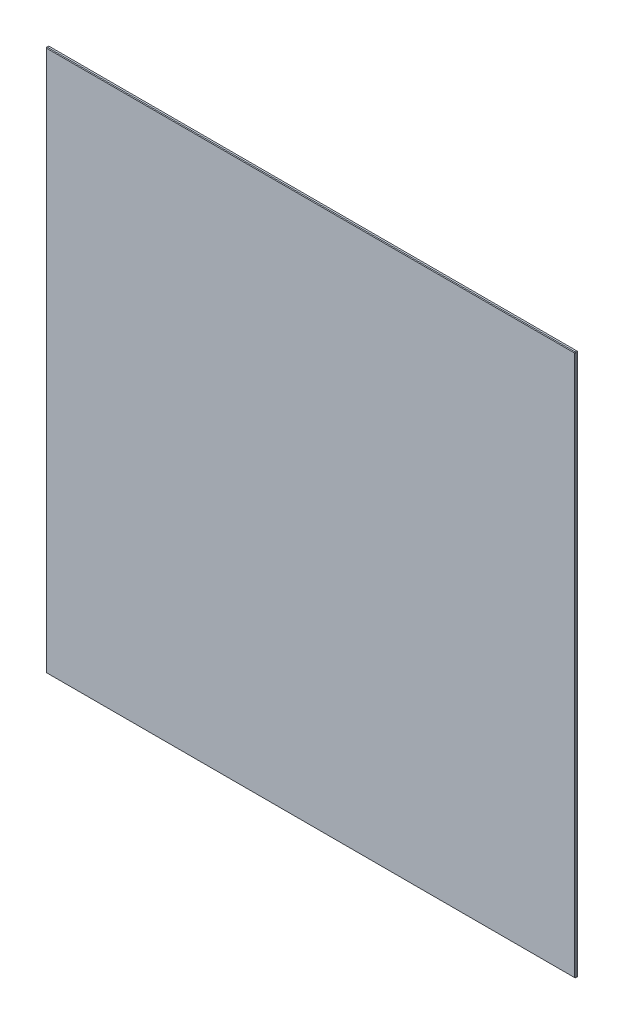
ISO-10303-21;
HEADER;
FILE_DESCRIPTION(('STEP AP214'),'2;1');
FILE_NAME('part.step','',(''),(''),'','','');
FILE_SCHEMA(('AUTOMOTIVE_DESIGN { 1 0 10303 214 1 1 1 1 }'));
ENDSEC;
DATA;
#1=APPLICATION_CONTEXT('core data for automotive mechanical design processes');
#2=APPLICATION_PROTOCOL_DEFINITION('international standard','automotive_design',2000,#1);
#3=PRODUCT_CONTEXT('',#1,'mechanical');
#4=PRODUCT('Part','Part','',(#3));
#5=PRODUCT_RELATED_PRODUCT_CATEGORY('part','',(#4));
#6=PRODUCT_DEFINITION_FORMATION('','',#4);
#7=PRODUCT_DEFINITION_CONTEXT('part definition',#1,'design');
#8=PRODUCT_DEFINITION('design','',#6,#7);
#9=PRODUCT_DEFINITION_SHAPE('','',#8);
#10=(LENGTH_UNIT() NAMED_UNIT(*) SI_UNIT(.MILLI.,.METRE.));
#11=(NAMED_UNIT(*) PLANE_ANGLE_UNIT() SI_UNIT($,.RADIAN.));
#12=(NAMED_UNIT(*) SI_UNIT($,.STERADIAN.) SOLID_ANGLE_UNIT());
#13=UNCERTAINTY_MEASURE_WITH_UNIT(LENGTH_MEASURE(1.E-05),#10,'distance_accuracy_value','');
#14=(GEOMETRIC_REPRESENTATION_CONTEXT(3) GLOBAL_UNCERTAINTY_ASSIGNED_CONTEXT((#13)) GLOBAL_UNIT_ASSIGNED_CONTEXT((#10,
#11,#12)) REPRESENTATION_CONTEXT('',''));
#15=CARTESIAN_POINT('',(0.,0.,0.));
#16=DIRECTION('',(0.,0.,1.));
#17=DIRECTION('',(1.,0.,0.));
#18=AXIS2_PLACEMENT_3D('',#15,#16,#17);
#19=CARTESIAN_POINT('',(210.,-215.,2.38125));
#20=DIRECTION('',(-1.,0.,0.));
#21=DIRECTION('',(0.,0.,1.));
#22=AXIS2_PLACEMENT_3D('',#19,#20,#21);
#23=PLANE('',#22);
#24=DIRECTION('',(0.,0.,-1.));
#25=VECTOR('',#24,1.);
#26=CARTESIAN_POINT('',(210.,-214.5,2.38125));
#27=LINE('',#26,#25);
#28=CARTESIAN_POINT('',(210.,-214.5,1.88125));
#29=VERTEX_POINT('',#28);
#30=CARTESIAN_POINT('',(210.,-214.5,0.500000000000056));
#31=VERTEX_POINT('',#30);
#32=EDGE_CURVE('E190',#29,#31,#27,.T.);
#33=ORIENTED_EDGE('',*,*,#32,.T.);
#34=DIRECTION('',(0.,1.,0.));
#35=VECTOR('',#34,1.);
#36=CARTESIAN_POINT('',(210.,215.,0.500000000000056));
#37=LINE('',#36,#35);
#38=CARTESIAN_POINT('',(210.,214.5,0.500000000000056));
#39=VERTEX_POINT('',#38);
#40=EDGE_CURVE('E192',#31,#39,#37,.T.);
#41=ORIENTED_EDGE('',*,*,#40,.T.);
#42=DIRECTION('',(0.,0.,1.));
#43=VECTOR('',#42,1.);
#44=CARTESIAN_POINT('',(210.,214.5,2.38125));
#45=LINE('',#44,#43);
#46=CARTESIAN_POINT('',(210.,214.5,1.88125));
#47=VERTEX_POINT('',#46);
#48=EDGE_CURVE('E186',#39,#47,#45,.T.);
#49=ORIENTED_EDGE('',*,*,#48,.T.);
#50=DIRECTION('',(0.,-1.,0.));
#51=VECTOR('',#50,1.);
#52=CARTESIAN_POINT('',(210.,-215.,1.88125));
#53=LINE('',#52,#51);
#54=EDGE_CURVE('E188',#47,#29,#53,.T.);
#55=ORIENTED_EDGE('',*,*,#54,.T.);
#56=EDGE_LOOP('',(#33,#41,#49,#55));
#57=FACE_BOUND('',#56,.T.);
#58=ADVANCED_FACE('F33',(#57),#23,.F.);
#59=CARTESIAN_POINT('',(-210.,215.,2.38125));
#60=DIRECTION('',(0.,-1.,0.));
#61=DIRECTION('',(0.,0.,-1.));
#62=AXIS2_PLACEMENT_3D('',#59,#60,#61);
#63=PLANE('',#62);
#64=DIRECTION('',(0.,0.,-1.));
#65=VECTOR('',#64,1.);
#66=CARTESIAN_POINT('',(209.5,215.,2.38125));
#67=LINE('',#66,#65);
#68=CARTESIAN_POINT('',(209.5,215.,1.88125));
#69=VERTEX_POINT('',#68);
#70=CARTESIAN_POINT('',(209.5,215.,0.500000000000056));
#71=VERTEX_POINT('',#70);
#72=EDGE_CURVE('E155',#69,#71,#67,.T.);
#73=ORIENTED_EDGE('',*,*,#72,.T.);
#74=DIRECTION('',(-1.,0.,0.));
#75=VECTOR('',#74,1.);
#76=CARTESIAN_POINT('',(-210.,215.,0.500000000000056));
#77=LINE('',#76,#75);
#78=CARTESIAN_POINT('',(-209.5,215.,0.500000000000056));
#79=VERTEX_POINT('',#78);
#80=EDGE_CURVE('E127',#71,#79,#77,.T.);
#81=ORIENTED_EDGE('',*,*,#80,.T.);
#82=DIRECTION('',(0.,0.,1.));
#83=VECTOR('',#82,1.);
#84=CARTESIAN_POINT('',(-209.5,215.,2.38125));
#85=LINE('',#84,#83);
#86=CARTESIAN_POINT('',(-209.5,215.,1.88125));
#87=VERTEX_POINT('',#86);
#88=EDGE_CURVE('E145',#79,#87,#85,.T.);
#89=ORIENTED_EDGE('',*,*,#88,.T.);
#90=DIRECTION('',(1.,0.,0.));
#91=VECTOR('',#90,1.);
#92=CARTESIAN_POINT('',(-210.,215.,1.88125));
#93=LINE('',#92,#91);
#94=EDGE_CURVE('E151',#87,#69,#93,.T.);
#95=ORIENTED_EDGE('',*,*,#94,.T.);
#96=EDGE_LOOP('',(#73,#81,#89,#95));
#97=FACE_BOUND('',#96,.T.);
#98=ADVANCED_FACE('F153',(#97),#63,.F.);
#99=CARTESIAN_POINT('',(-210.,-215.,2.38125));
#100=DIRECTION('',(1.,0.,0.));
#101=DIRECTION('',(0.,0.,-1.));
#102=AXIS2_PLACEMENT_3D('',#99,#100,#101);
#103=PLANE('',#102);
#104=DIRECTION('',(0.,0.,-1.));
#105=VECTOR('',#104,1.);
#106=CARTESIAN_POINT('',(-210.,214.5,2.38125));
#107=LINE('',#106,#105);
#108=CARTESIAN_POINT('',(-210.,214.5,1.88125));
#109=VERTEX_POINT('',#108);
#110=CARTESIAN_POINT('',(-210.,214.5,0.5));
#111=VERTEX_POINT('',#110);
#112=EDGE_CURVE('E172',#109,#111,#107,.T.);
#113=ORIENTED_EDGE('',*,*,#112,.T.);
#114=DIRECTION('',(0.,-1.,0.));
#115=VECTOR('',#114,1.);
#116=CARTESIAN_POINT('',(-210.,-215.,0.5));
#117=LINE('',#116,#115);
#118=CARTESIAN_POINT('',(-210.,-214.5,0.5));
#119=VERTEX_POINT('',#118);
#120=EDGE_CURVE('E174',#111,#119,#117,.T.);
#121=ORIENTED_EDGE('',*,*,#120,.T.);
#122=DIRECTION('',(0.,0.,1.));
#123=VECTOR('',#122,1.);
#124=CARTESIAN_POINT('',(-210.,-214.5,2.38125));
#125=LINE('',#124,#123);
#126=CARTESIAN_POINT('',(-210.,-214.5,1.88125));
#127=VERTEX_POINT('',#126);
#128=EDGE_CURVE('E168',#119,#127,#125,.T.);
#129=ORIENTED_EDGE('',*,*,#128,.T.);
#130=DIRECTION('',(0.,1.,0.));
#131=VECTOR('',#130,1.);
#132=CARTESIAN_POINT('',(-210.,-215.,1.88125));
#133=LINE('',#132,#131);
#134=EDGE_CURVE('E170',#127,#109,#133,.T.);
#135=ORIENTED_EDGE('',*,*,#134,.T.);
#136=EDGE_LOOP('',(#113,#121,#129,#135));
#137=FACE_BOUND('',#136,.T.);
#138=ADVANCED_FACE('F290',(#137),#103,.F.);
#139=CARTESIAN_POINT('',(-210.,-215.,2.38125));
#140=DIRECTION('',(0.,1.,0.));
#141=DIRECTION('',(0.,0.,1.));
#142=AXIS2_PLACEMENT_3D('',#139,#140,#141);
#143=PLANE('',#142);
#144=DIRECTION('',(1.,0.,0.));
#145=VECTOR('',#144,1.);
#146=CARTESIAN_POINT('',(210.,-215.,0.500000000000056));
#147=LINE('',#146,#145);
#148=CARTESIAN_POINT('',(-209.5,-215.,0.500000000000056));
#149=VERTEX_POINT('',#148);
#150=CARTESIAN_POINT('',(209.5,-215.,0.500000000000056));
#151=VERTEX_POINT('',#150);
#152=EDGE_CURVE('E181',#149,#151,#147,.T.);
#153=ORIENTED_EDGE('',*,*,#152,.T.);
#154=DIRECTION('',(0.,0.,1.));
#155=VECTOR('',#154,1.);
#156=CARTESIAN_POINT('',(209.5,-215.,2.38125));
#157=LINE('',#156,#155);
#158=CARTESIAN_POINT('',(209.5,-215.,1.88124999999994));
#159=VERTEX_POINT('',#158);
#160=EDGE_CURVE('E184',#151,#159,#157,.T.);
#161=ORIENTED_EDGE('',*,*,#160,.T.);
#162=DIRECTION('',(-1.,0.,0.));
#163=VECTOR('',#162,1.);
#164=CARTESIAN_POINT('',(-210.,-215.,1.88124999999994));
#165=LINE('',#164,#163);
#166=CARTESIAN_POINT('',(-209.5,-215.,1.88124999999994));
#167=VERTEX_POINT('',#166);
#168=EDGE_CURVE('E179',#159,#167,#165,.T.);
#169=ORIENTED_EDGE('',*,*,#168,.T.);
#170=DIRECTION('',(0.,0.,-1.));
#171=VECTOR('',#170,1.);
#172=CARTESIAN_POINT('',(-209.5,-215.,2.38125));
#173=LINE('',#172,#171);
#174=EDGE_CURVE('E177',#167,#149,#173,.T.);
#175=ORIENTED_EDGE('',*,*,#174,.T.);
#176=EDGE_LOOP('',(#153,#161,#169,#175));
#177=FACE_BOUND('',#176,.T.);
#178=ADVANCED_FACE('F353',(#177),#143,.F.);
#179=CARTESIAN_POINT('',(0.,0.,2.38125));
#180=DIRECTION('',(0.,0.,-1.));
#181=DIRECTION('',(-1.,0.,0.));
#182=AXIS2_PLACEMENT_3D('',#179,#180,#181);
#183=PLANE('',#182);
#184=DIRECTION('',(0.,-1.,0.));
#185=VECTOR('',#184,1.);
#186=CARTESIAN_POINT('',(-209.5,0.,2.38125));
#187=LINE('',#186,#185);
#188=CARTESIAN_POINT('',(-209.5,214.5,2.38125));
#189=VERTEX_POINT('',#188);
#190=CARTESIAN_POINT('',(-209.5,-214.5,2.38125));
#191=VERTEX_POINT('',#190);
#192=EDGE_CURVE('E195',#189,#191,#187,.T.);
#193=ORIENTED_EDGE('',*,*,#192,.T.);
#194=DIRECTION('',(1.,0.,0.));
#195=VECTOR('',#194,1.);
#196=CARTESIAN_POINT('',(0.,-214.5,2.38125));
#197=LINE('',#196,#195);
#198=CARTESIAN_POINT('',(209.5,-214.5,2.38125));
#199=VERTEX_POINT('',#198);
#200=EDGE_CURVE('E11',#191,#199,#197,.T.);
#201=ORIENTED_EDGE('',*,*,#200,.T.);
#202=DIRECTION('',(0.,1.,0.));
#203=VECTOR('',#202,1.);
#204=CARTESIAN_POINT('',(209.5,0.,2.38125));
#205=LINE('',#204,#203);
#206=CARTESIAN_POINT('',(209.5,214.5,2.38125));
#207=VERTEX_POINT('',#206);
#208=EDGE_CURVE('E42',#199,#207,#205,.T.);
#209=ORIENTED_EDGE('',*,*,#208,.T.);
#210=DIRECTION('',(-1.,0.,0.));
#211=VECTOR('',#210,1.);
#212=CARTESIAN_POINT('',(0.,214.5,2.38125));
#213=LINE('',#212,#211);
#214=EDGE_CURVE('E197',#207,#189,#213,.T.);
#215=ORIENTED_EDGE('',*,*,#214,.T.);
#216=EDGE_LOOP('',(#193,#201,#209,#215));
#217=FACE_BOUND('',#216,.T.);
#218=ADVANCED_FACE('F363',(#217),#183,.F.);
#219=CARTESIAN_POINT('',(0.,0.,0.));
#220=DIRECTION('',(0.,0.,-1.));
#221=DIRECTION('',(-1.,0.,0.));
#222=AXIS2_PLACEMENT_3D('',#219,#220,#221);
#223=PLANE('',#222);
#224=DIRECTION('',(0.,1.,0.));
#225=VECTOR('',#224,1.);
#226=CARTESIAN_POINT('',(-209.5,215.,0.));
#227=LINE('',#226,#225);
#228=CARTESIAN_POINT('',(-209.5,-214.5,0.));
#229=VERTEX_POINT('',#228);
#230=CARTESIAN_POINT('',(-209.5,214.5,0.));
#231=VERTEX_POINT('',#230);
#232=EDGE_CURVE('E165',#229,#231,#227,.T.);
#233=ORIENTED_EDGE('',*,*,#232,.T.);
#234=DIRECTION('',(1.,0.,0.));
#235=VECTOR('',#234,1.);
#236=CARTESIAN_POINT('',(210.,214.5,0.));
#237=LINE('',#236,#235);
#238=CARTESIAN_POINT('',(209.5,214.5,0.));
#239=VERTEX_POINT('',#238);
#240=EDGE_CURVE('E129',#231,#239,#237,.T.);
#241=ORIENTED_EDGE('',*,*,#240,.T.);
#242=DIRECTION('',(0.,-1.,0.));
#243=VECTOR('',#242,1.);
#244=CARTESIAN_POINT('',(209.5,-215.,0.));
#245=LINE('',#244,#243);
#246=CARTESIAN_POINT('',(209.5,-214.5,0.));
#247=VERTEX_POINT('',#246);
#248=EDGE_CURVE('E157',#239,#247,#245,.T.);
#249=ORIENTED_EDGE('',*,*,#248,.T.);
#250=DIRECTION('',(-1.,0.,0.));
#251=VECTOR('',#250,1.);
#252=CARTESIAN_POINT('',(-210.,-214.5,0.));
#253=LINE('',#252,#251);
#254=EDGE_CURVE('E159',#247,#229,#253,.T.);
#255=ORIENTED_EDGE('',*,*,#254,.T.);
#256=EDGE_LOOP('',(#233,#241,#249,#255));
#257=FACE_BOUND('',#256,.T.);
#258=ADVANCED_FACE('F365',(#257),#223,.T.);
#259=CARTESIAN_POINT('',(0.,-214.5,2.38125));
#260=DIRECTION('',(0.,0.707106781186587,-0.707106781186508));
#261=DIRECTION('',(1.,0.,0.));
#262=AXIS2_PLACEMENT_3D('',#259,#260,#261);
#263=PLANE('',#262);
#264=DIRECTION('',(0.,0.707106781186508,0.707106781186587));
#265=VECTOR('',#264,1.);
#266=CARTESIAN_POINT('',(209.5,-214.5,2.38125));
#267=LINE('',#266,#265);
#268=EDGE_CURVE('E37',#199,#159,#267,.F.);
#269=ORIENTED_EDGE('',*,*,#268,.F.);
#270=ORIENTED_EDGE('',*,*,#200,.F.);
#271=DIRECTION('',(0.,-0.707106781186508,-0.707106781186587));
#272=VECTOR('',#271,1.);
#273=CARTESIAN_POINT('',(-209.5,-215.,1.88124999999994));
#274=LINE('',#273,#272);
#275=EDGE_CURVE('E248',#167,#191,#274,.F.);
#276=ORIENTED_EDGE('',*,*,#275,.F.);
#277=ORIENTED_EDGE('',*,*,#168,.F.);
#278=EDGE_LOOP('',(#269,#270,#276,#277));
#279=FACE_BOUND('',#278,.T.);
#280=ADVANCED_FACE('F35',(#279),#263,.F.);
#281=CARTESIAN_POINT('',(209.5,-214.5,2.38125));
#282=DIRECTION('',(0.577350269189562,-0.57735026918969,0.577350269189626));
#283=DIRECTION('',(0.,-0.707106781186508,-0.707106781186587));
#284=AXIS2_PLACEMENT_3D('',#281,#282,#283);
#285=PLANE('',#284);
#286=DIRECTION('',(0.707106781186587,0.,-0.707106781186508));
#287=VECTOR('',#286,1.);
#288=CARTESIAN_POINT('',(209.5,-214.5,2.38125));
#289=LINE('',#288,#287);
#290=EDGE_CURVE('E244',#199,#29,#289,.T.);
#291=ORIENTED_EDGE('',*,*,#290,.F.);
#292=ORIENTED_EDGE('',*,*,#268,.T.);
#293=DIRECTION('',(-0.707106781186587,-0.707106781186508,0.));
#294=VECTOR('',#293,1.);
#295=CARTESIAN_POINT('',(209.75,-214.75,1.88124999999997));
#296=LINE('',#295,#294);
#297=EDGE_CURVE('E246',#29,#159,#296,.T.);
#298=ORIENTED_EDGE('',*,*,#297,.F.);
#299=EDGE_LOOP('',(#291,#292,#298));
#300=FACE_BOUND('',#299,.T.);
#301=ADVANCED_FACE('F258',(#300),#285,.T.);
#302=CARTESIAN_POINT('',(-209.5,-215.,1.88124999999994));
#303=DIRECTION('',(-0.577350269189562,-0.57735026918969,0.577350269189626));
#304=DIRECTION('',(0.,-0.707106781186508,-0.707106781186587));
#305=AXIS2_PLACEMENT_3D('',#302,#303,#304);
#306=PLANE('',#305);
#307=DIRECTION('',(-0.707106781186587,0.707106781186508,0.));
#308=VECTOR('',#307,1.);
#309=CARTESIAN_POINT('',(-209.5,-215.,1.88124999999994));
#310=LINE('',#309,#308);
#311=EDGE_CURVE('E238',#167,#127,#310,.T.);
#312=ORIENTED_EDGE('',*,*,#311,.F.);
#313=ORIENTED_EDGE('',*,*,#275,.T.);
#314=DIRECTION('',(0.707106781186587,0.,0.707106781186508));
#315=VECTOR('',#314,1.);
#316=CARTESIAN_POINT('',(-209.75,-214.5,2.13125));
#317=LINE('',#316,#315);
#318=EDGE_CURVE('E241',#127,#191,#317,.T.);
#319=ORIENTED_EDGE('',*,*,#318,.F.);
#320=EDGE_LOOP('',(#312,#313,#319));
#321=FACE_BOUND('',#320,.T.);
#322=ADVANCED_FACE('F283',(#321),#306,.T.);
#323=CARTESIAN_POINT('',(210.,-214.5,2.38125));
#324=DIRECTION('',(-0.707106781186508,0.707106781186587,0.));
#325=DIRECTION('',(0.,0.,-1.));
#326=AXIS2_PLACEMENT_3D('',#323,#324,#325);
#327=PLANE('',#326);
#328=ORIENTED_EDGE('',*,*,#297,.T.);
#329=ORIENTED_EDGE('',*,*,#160,.F.);
#330=DIRECTION('',(0.707106781186587,0.707106781186508,0.));
#331=VECTOR('',#330,1.);
#332=CARTESIAN_POINT('',(209.5,-215.,0.500000000000056));
#333=LINE('',#332,#331);
#334=EDGE_CURVE('E233',#31,#151,#333,.F.);
#335=ORIENTED_EDGE('',*,*,#334,.F.);
#336=ORIENTED_EDGE('',*,*,#32,.F.);
#337=EDGE_LOOP('',(#328,#329,#335,#336));
#338=FACE_BOUND('',#337,.T.);
#339=ADVANCED_FACE('F265',(#338),#327,.F.);
#340=CARTESIAN_POINT('',(209.5,0.,2.38125));
#341=DIRECTION('',(-0.707106781186508,0.,-0.707106781186587));
#342=DIRECTION('',(0.,1.,0.));
#343=AXIS2_PLACEMENT_3D('',#340,#341,#342);
#344=PLANE('',#343);
#345=ORIENTED_EDGE('',*,*,#290,.T.);
#346=ORIENTED_EDGE('',*,*,#54,.F.);
#347=DIRECTION('',(-0.707106781186587,-1.17685316406672E-13,0.707106781186508));
#348=VECTOR('',#347,1.);
#349=CARTESIAN_POINT('',(209.5,214.5,2.38125));
#350=LINE('',#349,#348);
#351=EDGE_CURVE('E230',#207,#47,#350,.F.);
#352=ORIENTED_EDGE('',*,*,#351,.F.);
#353=ORIENTED_EDGE('',*,*,#208,.F.);
#354=EDGE_LOOP('',(#345,#346,#352,#353));
#355=FACE_BOUND('',#354,.T.);
#356=ADVANCED_FACE('F272',(#355),#344,.F.);
#357=CARTESIAN_POINT('',(0.,214.5,2.38125));
#358=DIRECTION('',(0.,-0.707106781186508,-0.707106781186587));
#359=DIRECTION('',(-1.,0.,0.));
#360=AXIS2_PLACEMENT_3D('',#357,#358,#359);
#361=PLANE('',#360);
#362=DIRECTION('',(0.,-0.707106781186587,0.707106781186508));
#363=VECTOR('',#362,1.);
#364=CARTESIAN_POINT('',(-209.5,214.5,2.38125));
#365=LINE('',#364,#363);
#366=EDGE_CURVE('E224',#189,#87,#365,.F.);
#367=ORIENTED_EDGE('',*,*,#366,.F.);
#368=ORIENTED_EDGE('',*,*,#214,.F.);
#369=DIRECTION('',(0.,0.707106781186587,-0.707106781186508));
#370=VECTOR('',#369,1.);
#371=CARTESIAN_POINT('',(209.5,214.5,2.38125));
#372=LINE('',#371,#370);
#373=EDGE_CURVE('E227',#69,#207,#372,.F.);
#374=ORIENTED_EDGE('',*,*,#373,.F.);
#375=ORIENTED_EDGE('',*,*,#94,.F.);
#376=EDGE_LOOP('',(#367,#368,#374,#375));
#377=FACE_BOUND('',#376,.T.);
#378=ADVANCED_FACE('F274',(#377),#361,.F.);
#379=CARTESIAN_POINT('',(-209.5,0.,2.38125));
#380=DIRECTION('',(0.707106781186508,0.,-0.707106781186587));
#381=DIRECTION('',(0.,-1.,0.));
#382=AXIS2_PLACEMENT_3D('',#379,#380,#381);
#383=PLANE('',#382);
#384=ORIENTED_EDGE('',*,*,#318,.T.);
#385=ORIENTED_EDGE('',*,*,#192,.F.);
#386=DIRECTION('',(-0.707106781186587,1.17685316406672E-13,-0.707106781186508));
#387=VECTOR('',#386,1.);
#388=CARTESIAN_POINT('',(-209.5,214.5,2.38125));
#389=LINE('',#388,#387);
#390=EDGE_CURVE('E221',#109,#189,#389,.F.);
#391=ORIENTED_EDGE('',*,*,#390,.F.);
#392=ORIENTED_EDGE('',*,*,#134,.F.);
#393=EDGE_LOOP('',(#384,#385,#391,#392));
#394=FACE_BOUND('',#393,.T.);
#395=ADVANCED_FACE('F280',(#394),#383,.F.);
#396=CARTESIAN_POINT('',(-209.5,-215.,2.38125));
#397=DIRECTION('',(0.707106781186508,0.707106781186587,0.));
#398=DIRECTION('',(0.,0.,-1.));
#399=AXIS2_PLACEMENT_3D('',#396,#397,#398);
#400=PLANE('',#399);
#401=ORIENTED_EDGE('',*,*,#311,.T.);
#402=ORIENTED_EDGE('',*,*,#128,.F.);
#403=DIRECTION('',(0.707106781186587,-0.707106781186508,0.));
#404=VECTOR('',#403,1.);
#405=CARTESIAN_POINT('',(-210.,-214.5,0.5));
#406=LINE('',#405,#404);
#407=EDGE_CURVE('E218',#149,#119,#406,.F.);
#408=ORIENTED_EDGE('',*,*,#407,.F.);
#409=ORIENTED_EDGE('',*,*,#174,.F.);
#410=EDGE_LOOP('',(#401,#402,#408,#409));
#411=FACE_BOUND('',#410,.T.);
#412=ADVANCED_FACE('F335',(#411),#400,.F.);
#413=CARTESIAN_POINT('',(-210.,-215.,0.500000000000056));
#414=DIRECTION('',(0.,-0.707106781186587,-0.707106781186508));
#415=DIRECTION('',(-1.,0.,0.));
#416=AXIS2_PLACEMENT_3D('',#413,#414,#415);
#417=PLANE('',#416);
#418=DIRECTION('',(0.,0.707106781186508,-0.707106781186587));
#419=VECTOR('',#418,1.);
#420=CARTESIAN_POINT('',(209.5,-215.,0.500000000000056));
#421=LINE('',#420,#419);
#422=EDGE_CURVE('E235',#151,#247,#421,.T.);
#423=ORIENTED_EDGE('',*,*,#422,.F.);
#424=ORIENTED_EDGE('',*,*,#152,.F.);
#425=DIRECTION('',(0.,-0.707106781186508,0.707106781186587));
#426=VECTOR('',#425,1.);
#427=CARTESIAN_POINT('',(-209.5,-214.75,0.250000000000028));
#428=LINE('',#427,#426);
#429=EDGE_CURVE('E215',#229,#149,#428,.T.);
#430=ORIENTED_EDGE('',*,*,#429,.F.);
#431=ORIENTED_EDGE('',*,*,#254,.F.);
#432=EDGE_LOOP('',(#423,#424,#430,#431));
#433=FACE_BOUND('',#432,.T.);
#434=ADVANCED_FACE('F331',(#433),#417,.T.);
#435=CARTESIAN_POINT('',(209.5,-215.,0.500000000000056));
#436=DIRECTION('',(0.577350269189626,-0.57735026918969,-0.577350269189562));
#437=DIRECTION('',(0.707106781186587,0.707106781186508,0.));
#438=AXIS2_PLACEMENT_3D('',#435,#436,#437);
#439=PLANE('',#438);
#440=ORIENTED_EDGE('',*,*,#334,.T.);
#441=ORIENTED_EDGE('',*,*,#422,.T.);
#442=DIRECTION('',(0.707106781186508,0.,0.707106781186587));
#443=VECTOR('',#442,1.);
#444=CARTESIAN_POINT('',(209.75,-214.5,0.250000000000028));
#445=LINE('',#444,#443);
#446=EDGE_CURVE('E212',#31,#247,#445,.F.);
#447=ORIENTED_EDGE('',*,*,#446,.F.);
#448=EDGE_LOOP('',(#440,#441,#447));
#449=FACE_BOUND('',#448,.T.);
#450=ADVANCED_FACE('F327',(#449),#439,.T.);
#451=CARTESIAN_POINT('',(209.5,214.5,2.38125));
#452=DIRECTION('',(0.57735026918954,0.577350269189637,0.577350269189701));
#453=DIRECTION('',(0.,-0.707106781186587,0.707106781186508));
#454=AXIS2_PLACEMENT_3D('',#451,#452,#453);
#455=PLANE('',#454);
#456=ORIENTED_EDGE('',*,*,#373,.T.);
#457=ORIENTED_EDGE('',*,*,#351,.T.);
#458=DIRECTION('',(0.707106781186606,-0.707106781186489,0.));
#459=VECTOR('',#458,1.);
#460=CARTESIAN_POINT('',(209.75,214.75,1.88125));
#461=LINE('',#460,#459);
#462=EDGE_CURVE('E209',#69,#47,#461,.T.);
#463=ORIENTED_EDGE('',*,*,#462,.F.);
#464=EDGE_LOOP('',(#456,#457,#463));
#465=FACE_BOUND('',#464,.T.);
#466=ADVANCED_FACE('F323',(#465),#455,.T.);
#467=CARTESIAN_POINT('',(-209.5,214.5,2.38125));
#468=DIRECTION('',(-0.57735026918954,0.577350269189637,0.577350269189701));
#469=DIRECTION('',(0.,-0.707106781186587,0.707106781186508));
#470=AXIS2_PLACEMENT_3D('',#467,#468,#469);
#471=PLANE('',#470);
#472=ORIENTED_EDGE('',*,*,#390,.T.);
#473=ORIENTED_EDGE('',*,*,#366,.T.);
#474=DIRECTION('',(0.707106781186606,0.707106781186489,0.));
#475=VECTOR('',#474,1.);
#476=CARTESIAN_POINT('',(-209.75,214.75,1.88125));
#477=LINE('',#476,#475);
#478=EDGE_CURVE('E148',#109,#87,#477,.T.);
#479=ORIENTED_EDGE('',*,*,#478,.F.);
#480=EDGE_LOOP('',(#472,#473,#479));
#481=FACE_BOUND('',#480,.T.);
#482=ADVANCED_FACE('F319',(#481),#471,.T.);
#483=CARTESIAN_POINT('',(-210.,-214.5,0.5));
#484=DIRECTION('',(-0.577350269189562,-0.57735026918969,-0.577350269189626));
#485=DIRECTION('',(0.,0.707106781186508,-0.707106781186587));
#486=AXIS2_PLACEMENT_3D('',#483,#484,#485);
#487=PLANE('',#486);
#488=ORIENTED_EDGE('',*,*,#429,.T.);
#489=ORIENTED_EDGE('',*,*,#407,.T.);
#490=DIRECTION('',(0.707106781186587,0.,-0.707106781186508));
#491=VECTOR('',#490,1.);
#492=CARTESIAN_POINT('',(-210.,-214.5,0.5));
#493=LINE('',#492,#491);
#494=EDGE_CURVE('E206',#229,#119,#493,.F.);
#495=ORIENTED_EDGE('',*,*,#494,.F.);
#496=EDGE_LOOP('',(#488,#489,#495));
#497=FACE_BOUND('',#496,.T.);
#498=ADVANCED_FACE('F315',(#497),#487,.T.);
#499=CARTESIAN_POINT('',(210.,-215.,0.500000000000056));
#500=DIRECTION('',(0.707106781186587,0.,-0.707106781186508));
#501=DIRECTION('',(0.,-1.,0.));
#502=AXIS2_PLACEMENT_3D('',#499,#500,#501);
#503=PLANE('',#502);
#504=ORIENTED_EDGE('',*,*,#446,.T.);
#505=ORIENTED_EDGE('',*,*,#248,.F.);
#506=DIRECTION('',(-0.707106781186508,0.,-0.707106781186587));
#507=VECTOR('',#506,1.);
#508=CARTESIAN_POINT('',(209.5,214.5,0.));
#509=LINE('',#508,#507);
#510=EDGE_CURVE('E203',#39,#239,#509,.T.);
#511=ORIENTED_EDGE('',*,*,#510,.F.);
#512=ORIENTED_EDGE('',*,*,#40,.F.);
#513=EDGE_LOOP('',(#504,#505,#511,#512));
#514=FACE_BOUND('',#513,.T.);
#515=ADVANCED_FACE('F311',(#514),#503,.T.);
#516=CARTESIAN_POINT('',(209.5,215.,2.38125));
#517=DIRECTION('',(-0.707106781186489,-0.707106781186606,0.));
#518=DIRECTION('',(0.,0.,-1.));
#519=AXIS2_PLACEMENT_3D('',#516,#517,#518);
#520=PLANE('',#519);
#521=ORIENTED_EDGE('',*,*,#462,.T.);
#522=ORIENTED_EDGE('',*,*,#48,.F.);
#523=DIRECTION('',(-0.707106781186606,0.707106781186489,0.));
#524=VECTOR('',#523,1.);
#525=CARTESIAN_POINT('',(209.75,214.75,0.500000000000056));
#526=LINE('',#525,#524);
#527=EDGE_CURVE('E142',#71,#39,#526,.F.);
#528=ORIENTED_EDGE('',*,*,#527,.F.);
#529=ORIENTED_EDGE('',*,*,#72,.F.);
#530=EDGE_LOOP('',(#521,#522,#528,#529));
#531=FACE_BOUND('',#530,.T.);
#532=ADVANCED_FACE('F308',(#531),#520,.F.);
#533=CARTESIAN_POINT('',(-210.,214.5,2.38125));
#534=DIRECTION('',(0.707106781186489,-0.707106781186606,0.));
#535=DIRECTION('',(0.,0.,-1.));
#536=AXIS2_PLACEMENT_3D('',#533,#534,#535);
#537=PLANE('',#536);
#538=ORIENTED_EDGE('',*,*,#478,.T.);
#539=ORIENTED_EDGE('',*,*,#88,.F.);
#540=DIRECTION('',(-0.707106781186606,-0.707106781186489,0.));
#541=VECTOR('',#540,1.);
#542=CARTESIAN_POINT('',(-209.5,215.,0.500000000000056));
#543=LINE('',#542,#541);
#544=EDGE_CURVE('E135',#111,#79,#543,.F.);
#545=ORIENTED_EDGE('',*,*,#544,.F.);
#546=ORIENTED_EDGE('',*,*,#112,.F.);
#547=EDGE_LOOP('',(#538,#539,#545,#546));
#548=FACE_BOUND('',#547,.T.);
#549=ADVANCED_FACE('F146',(#548),#537,.F.);
#550=CARTESIAN_POINT('',(-210.,-215.,0.5));
#551=DIRECTION('',(-0.707106781186508,0.,-0.707106781186587));
#552=DIRECTION('',(0.,1.,0.));
#553=AXIS2_PLACEMENT_3D('',#550,#551,#552);
#554=PLANE('',#553);
#555=ORIENTED_EDGE('',*,*,#494,.T.);
#556=ORIENTED_EDGE('',*,*,#120,.F.);
#557=DIRECTION('',(-0.707106781186587,0.,0.707106781186508));
#558=VECTOR('',#557,1.);
#559=CARTESIAN_POINT('',(-209.75,214.5,0.250000000000014));
#560=LINE('',#559,#558);
#561=EDGE_CURVE('E139',#231,#111,#560,.T.);
#562=ORIENTED_EDGE('',*,*,#561,.F.);
#563=ORIENTED_EDGE('',*,*,#232,.F.);
#564=EDGE_LOOP('',(#555,#556,#562,#563));
#565=FACE_BOUND('',#564,.T.);
#566=ADVANCED_FACE('F301',(#565),#554,.T.);
#567=CARTESIAN_POINT('',(209.5,214.5,0.));
#568=DIRECTION('',(0.577350269189604,0.577350269189701,-0.577350269189572));
#569=DIRECTION('',(-0.707106781186606,0.707106781186489,0.));
#570=AXIS2_PLACEMENT_3D('',#567,#568,#569);
#571=PLANE('',#570);
#572=ORIENTED_EDGE('',*,*,#527,.T.);
#573=ORIENTED_EDGE('',*,*,#510,.T.);
#574=DIRECTION('',(0.,0.707106781186508,0.707106781186587));
#575=VECTOR('',#574,1.);
#576=CARTESIAN_POINT('',(209.5,214.5,0.));
#577=LINE('',#576,#575);
#578=EDGE_CURVE('E132',#71,#239,#577,.F.);
#579=ORIENTED_EDGE('',*,*,#578,.F.);
#580=EDGE_LOOP('',(#572,#573,#579));
#581=FACE_BOUND('',#580,.T.);
#582=ADVANCED_FACE('F298',(#581),#571,.T.);
#583=CARTESIAN_POINT('',(-209.5,215.,0.500000000000056));
#584=DIRECTION('',(-0.57735026918954,0.577350269189701,-0.577350269189637));
#585=DIRECTION('',(0.,0.707106781186508,0.707106781186587));
#586=AXIS2_PLACEMENT_3D('',#583,#584,#585);
#587=PLANE('',#586);
#588=ORIENTED_EDGE('',*,*,#561,.T.);
#589=ORIENTED_EDGE('',*,*,#544,.T.);
#590=DIRECTION('',(0.,-0.707106781186508,-0.707106781186587));
#591=VECTOR('',#590,1.);
#592=CARTESIAN_POINT('',(-209.5,215.,0.500000000000056));
#593=LINE('',#592,#591);
#594=EDGE_CURVE('E123',#231,#79,#593,.F.);
#595=ORIENTED_EDGE('',*,*,#594,.F.);
#596=EDGE_LOOP('',(#588,#589,#595));
#597=FACE_BOUND('',#596,.T.);
#598=ADVANCED_FACE('F137',(#597),#587,.T.);
#599=CARTESIAN_POINT('',(-210.,215.,0.500000000000056));
#600=DIRECTION('',(0.,0.707106781186587,-0.707106781186508));
#601=DIRECTION('',(1.,0.,0.));
#602=AXIS2_PLACEMENT_3D('',#599,#600,#601);
#603=PLANE('',#602);
#604=ORIENTED_EDGE('',*,*,#578,.T.);
#605=ORIENTED_EDGE('',*,*,#240,.F.);
#606=ORIENTED_EDGE('',*,*,#594,.T.);
#607=ORIENTED_EDGE('',*,*,#80,.F.);
#608=EDGE_LOOP('',(#604,#605,#606,#607));
#609=FACE_BOUND('',#608,.T.);
#610=ADVANCED_FACE('F125',(#609),#603,.T.);
#611=CLOSED_SHELL('',(#58,#98,#138,#178,#218,#258,#280,#301,#322,#339,#356,#378,#395,#412,#434,
#450,#466,#482,#498,#515,#532,#549,#566,#582,#598,#610));
#612=MANIFOLD_SOLID_BREP('B2',#611);
#613=ADVANCED_BREP_SHAPE_REPRESENTATION('',(#18,#612),#14);
#614=SHAPE_DEFINITION_REPRESENTATION(#9,#613);
ENDSEC;
END-ISO-10303-21;
